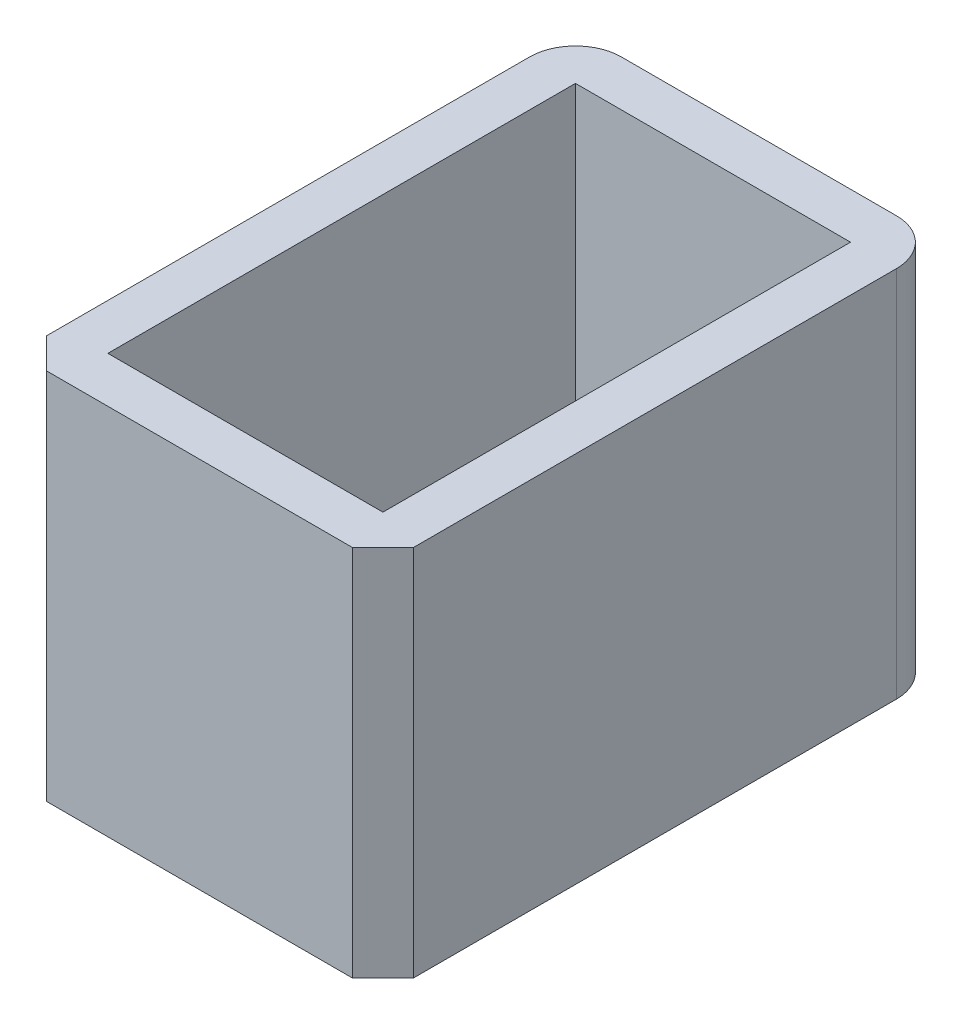
ISO-10303-21;
HEADER;
FILE_DESCRIPTION(('STEP AP214'),'2;1');
FILE_NAME('part.step','',(''),(''),'','','');
FILE_SCHEMA(('AUTOMOTIVE_DESIGN { 1 0 10303 214 1 1 1 1 }'));
ENDSEC;
DATA;
#1=APPLICATION_CONTEXT('core data for automotive mechanical design processes');
#2=APPLICATION_PROTOCOL_DEFINITION('international standard','automotive_design',2000,#1);
#3=PRODUCT_CONTEXT('',#1,'mechanical');
#4=PRODUCT('Part','Part','',(#3));
#5=PRODUCT_RELATED_PRODUCT_CATEGORY('part','',(#4));
#6=PRODUCT_DEFINITION_FORMATION('','',#4);
#7=PRODUCT_DEFINITION_CONTEXT('part definition',#1,'design');
#8=PRODUCT_DEFINITION('design','',#6,#7);
#9=PRODUCT_DEFINITION_SHAPE('','',#8);
#10=(LENGTH_UNIT() NAMED_UNIT(*) SI_UNIT(.MILLI.,.METRE.));
#11=(NAMED_UNIT(*) PLANE_ANGLE_UNIT() SI_UNIT($,.RADIAN.));
#12=(NAMED_UNIT(*) SI_UNIT($,.STERADIAN.) SOLID_ANGLE_UNIT());
#13=UNCERTAINTY_MEASURE_WITH_UNIT(LENGTH_MEASURE(1.E-05),#10,'distance_accuracy_value','');
#14=(GEOMETRIC_REPRESENTATION_CONTEXT(3) GLOBAL_UNCERTAINTY_ASSIGNED_CONTEXT((#13)) GLOBAL_UNIT_ASSIGNED_CONTEXT((#10,
#11,#12)) REPRESENTATION_CONTEXT('',''));
#15=CARTESIAN_POINT('',(0.,0.,0.));
#16=DIRECTION('',(0.,0.,1.));
#17=DIRECTION('',(1.,0.,0.));
#18=AXIS2_PLACEMENT_3D('',#15,#16,#17);
#19=CARTESIAN_POINT('',(0.,24.4,0.));
#20=DIRECTION('',(1.,0.,0.));
#21=DIRECTION('',(0.,0.,-1.));
#22=AXIS2_PLACEMENT_3D('',#19,#20,#21);
#23=PLANE('',#22);
#24=DIRECTION('',(0.,0.,1.));
#25=VECTOR('',#24,1.);
#26=CARTESIAN_POINT('',(0.,0.,0.));
#27=LINE('',#26,#25);
#28=CARTESIAN_POINT('',(0.,0.,-33.6));
#29=VERTEX_POINT('',#28);
#30=CARTESIAN_POINT('',(0.,0.,-2.00000000000001));
#31=VERTEX_POINT('',#30);
#32=EDGE_CURVE('E167',#29,#31,#27,.T.);
#33=ORIENTED_EDGE('',*,*,#32,.T.);
#34=DIRECTION('',(0.,1.,0.));
#35=VECTOR('',#34,1.);
#36=CARTESIAN_POINT('',(0.,24.4,-2.00000000000001));
#37=LINE('',#36,#35);
#38=CARTESIAN_POINT('',(0.,24.4,-2.00000000000001));
#39=VERTEX_POINT('',#38);
#40=EDGE_CURVE('E11',#31,#39,#37,.T.);
#41=ORIENTED_EDGE('',*,*,#40,.T.);
#42=DIRECTION('',(0.,0.,1.));
#43=VECTOR('',#42,1.);
#44=CARTESIAN_POINT('',(0.,24.4,0.));
#45=LINE('',#44,#43);
#46=CARTESIAN_POINT('',(0.,24.4,-33.6));
#47=VERTEX_POINT('',#46);
#48=EDGE_CURVE('E171',#47,#39,#45,.T.);
#49=ORIENTED_EDGE('',*,*,#48,.F.);
#50=DIRECTION('',(0.,-1.,0.));
#51=VECTOR('',#50,1.);
#52=CARTESIAN_POINT('',(0.,24.4,-33.6));
#53=LINE('',#52,#51);
#54=EDGE_CURVE('E205',#47,#29,#53,.T.);
#55=ORIENTED_EDGE('',*,*,#54,.T.);
#56=EDGE_LOOP('',(#33,#41,#49,#55));
#57=FACE_BOUND('',#56,.T.);
#58=ADVANCED_FACE('F35',(#57),#23,.F.);
#59=CARTESIAN_POINT('',(0.,24.4,0.));
#60=DIRECTION('',(0.,0.,-1.));
#61=DIRECTION('',(-1.,0.,0.));
#62=AXIS2_PLACEMENT_3D('',#59,#60,#61);
#63=PLANE('',#62);
#64=DIRECTION('',(1.,0.,0.));
#65=VECTOR('',#64,1.);
#66=CARTESIAN_POINT('',(0.,0.,0.));
#67=LINE('',#66,#65);
#68=CARTESIAN_POINT('',(1.99999999999999,0.,0.));
#69=VERTEX_POINT('',#68);
#70=CARTESIAN_POINT('',(22.,0.,0.));
#71=VERTEX_POINT('',#70);
#72=EDGE_CURVE('E183',#69,#71,#67,.T.);
#73=ORIENTED_EDGE('',*,*,#72,.T.);
#74=DIRECTION('',(0.,1.,0.));
#75=VECTOR('',#74,1.);
#76=CARTESIAN_POINT('',(22.,24.4,0.));
#77=LINE('',#76,#75);
#78=CARTESIAN_POINT('',(22.,24.4,0.));
#79=VERTEX_POINT('',#78);
#80=EDGE_CURVE('E57',#71,#79,#77,.T.);
#81=ORIENTED_EDGE('',*,*,#80,.T.);
#82=DIRECTION('',(1.,0.,0.));
#83=VECTOR('',#82,1.);
#84=CARTESIAN_POINT('',(0.,24.4,0.));
#85=LINE('',#84,#83);
#86=CARTESIAN_POINT('',(1.99999999999999,24.4,0.));
#87=VERTEX_POINT('',#86);
#88=EDGE_CURVE('E173',#87,#79,#85,.T.);
#89=ORIENTED_EDGE('',*,*,#88,.F.);
#90=DIRECTION('',(0.,-1.,0.));
#91=VECTOR('',#90,1.);
#92=CARTESIAN_POINT('',(1.99999999999999,24.4,0.));
#93=LINE('',#92,#91);
#94=EDGE_CURVE('E215',#87,#69,#93,.T.);
#95=ORIENTED_EDGE('',*,*,#94,.T.);
#96=EDGE_LOOP('',(#73,#81,#89,#95));
#97=FACE_BOUND('',#96,.T.);
#98=ADVANCED_FACE('F233',(#97),#63,.F.);
#99=CARTESIAN_POINT('',(24.,24.4,0.));
#100=DIRECTION('',(-1.,0.,0.));
#101=DIRECTION('',(0.,0.,1.));
#102=AXIS2_PLACEMENT_3D('',#99,#100,#101);
#103=PLANE('',#102);
#104=DIRECTION('',(0.,0.,-1.));
#105=VECTOR('',#104,1.);
#106=CARTESIAN_POINT('',(24.,24.4,0.));
#107=LINE('',#106,#105);
#108=CARTESIAN_POINT('',(24.,24.4,-1.99999999999999));
#109=VERTEX_POINT('',#108);
#110=CARTESIAN_POINT('',(24.,24.4,-33.6));
#111=VERTEX_POINT('',#110);
#112=EDGE_CURVE('E176',#109,#111,#107,.T.);
#113=ORIENTED_EDGE('',*,*,#112,.F.);
#114=DIRECTION('',(0.,-1.,0.));
#115=VECTOR('',#114,1.);
#116=CARTESIAN_POINT('',(24.,24.4,-1.99999999999999));
#117=LINE('',#116,#115);
#118=CARTESIAN_POINT('',(24.,0.,-1.99999999999999));
#119=VERTEX_POINT('',#118);
#120=EDGE_CURVE('E208',#109,#119,#117,.T.);
#121=ORIENTED_EDGE('',*,*,#120,.T.);
#122=DIRECTION('',(0.,0.,-1.));
#123=VECTOR('',#122,1.);
#124=CARTESIAN_POINT('',(24.,0.,0.));
#125=LINE('',#124,#123);
#126=CARTESIAN_POINT('',(24.,0.,-33.6));
#127=VERTEX_POINT('',#126);
#128=EDGE_CURVE('E185',#119,#127,#125,.T.);
#129=ORIENTED_EDGE('',*,*,#128,.T.);
#130=DIRECTION('',(0.,-1.,0.));
#131=VECTOR('',#130,1.);
#132=CARTESIAN_POINT('',(24.,24.4,-33.6));
#133=LINE('',#132,#131);
#134=EDGE_CURVE('E198',#127,#111,#133,.F.);
#135=ORIENTED_EDGE('',*,*,#134,.T.);
#136=EDGE_LOOP('',(#113,#121,#129,#135));
#137=FACE_BOUND('',#136,.T.);
#138=ADVANCED_FACE('F227',(#137),#103,.F.);
#139=CARTESIAN_POINT('',(0.,24.4,-36.6));
#140=DIRECTION('',(0.,0.,1.));
#141=DIRECTION('',(1.,0.,0.));
#142=AXIS2_PLACEMENT_3D('',#139,#140,#141);
#143=PLANE('',#142);
#144=DIRECTION('',(-1.,0.,0.));
#145=VECTOR('',#144,1.);
#146=CARTESIAN_POINT('',(0.,24.4,-36.6));
#147=LINE('',#146,#145);
#148=CARTESIAN_POINT('',(21.,24.4,-36.6));
#149=VERTEX_POINT('',#148);
#150=CARTESIAN_POINT('',(3.,24.4,-36.6));
#151=VERTEX_POINT('',#150);
#152=EDGE_CURVE('E178',#149,#151,#147,.T.);
#153=ORIENTED_EDGE('',*,*,#152,.F.);
#154=DIRECTION('',(0.,-1.,0.));
#155=VECTOR('',#154,1.);
#156=CARTESIAN_POINT('',(21.,24.4,-36.6));
#157=LINE('',#156,#155);
#158=CARTESIAN_POINT('',(21.,0.,-36.6));
#159=VERTEX_POINT('',#158);
#160=EDGE_CURVE('E190',#149,#159,#157,.T.);
#161=ORIENTED_EDGE('',*,*,#160,.T.);
#162=DIRECTION('',(-1.,0.,0.));
#163=VECTOR('',#162,1.);
#164=CARTESIAN_POINT('',(0.,0.,-36.6));
#165=LINE('',#164,#163);
#166=CARTESIAN_POINT('',(3.,0.,-36.6));
#167=VERTEX_POINT('',#166);
#168=EDGE_CURVE('E174',#159,#167,#165,.T.);
#169=ORIENTED_EDGE('',*,*,#168,.T.);
#170=DIRECTION('',(0.,-1.,0.));
#171=VECTOR('',#170,1.);
#172=CARTESIAN_POINT('',(3.,24.4,-36.6));
#173=LINE('',#172,#171);
#174=EDGE_CURVE('E181',#167,#151,#173,.F.);
#175=ORIENTED_EDGE('',*,*,#174,.T.);
#176=EDGE_LOOP('',(#153,#161,#169,#175));
#177=FACE_BOUND('',#176,.T.);
#178=ADVANCED_FACE('F246',(#177),#143,.F.);
#179=CARTESIAN_POINT('',(0.,24.4,0.));
#180=DIRECTION('',(0.,-1.,0.));
#181=DIRECTION('',(0.,0.,-1.));
#182=AXIS2_PLACEMENT_3D('',#179,#180,#181);
#183=PLANE('',#182);
#184=DIRECTION('',(1.,0.,0.));
#185=VECTOR('',#184,1.);
#186=CARTESIAN_POINT('',(3.,24.4,-3.));
#187=LINE('',#186,#185);
#188=CARTESIAN_POINT('',(3.,24.4,-3.));
#189=VERTEX_POINT('',#188);
#190=CARTESIAN_POINT('',(21.,24.4,-3.));
#191=VERTEX_POINT('',#190);
#192=EDGE_CURVE('E161',#189,#191,#187,.T.);
#193=ORIENTED_EDGE('',*,*,#192,.F.);
#194=DIRECTION('',(0.,0.,1.));
#195=VECTOR('',#194,1.);
#196=CARTESIAN_POINT('',(3.,24.4,-33.6));
#197=LINE('',#196,#195);
#198=CARTESIAN_POINT('',(3.,24.4,-33.6));
#199=VERTEX_POINT('',#198);
#200=EDGE_CURVE('E134',#199,#189,#197,.T.);
#201=ORIENTED_EDGE('',*,*,#200,.F.);
#202=DIRECTION('',(-1.,0.,0.));
#203=VECTOR('',#202,1.);
#204=CARTESIAN_POINT('',(3.,24.4,-33.6));
#205=LINE('',#204,#203);
#206=CARTESIAN_POINT('',(21.,24.4,-33.6));
#207=VERTEX_POINT('',#206);
#208=EDGE_CURVE('E152',#207,#199,#205,.T.);
#209=ORIENTED_EDGE('',*,*,#208,.F.);
#210=DIRECTION('',(0.,0.,-1.));
#211=VECTOR('',#210,1.);
#212=CARTESIAN_POINT('',(21.,24.4,-33.6));
#213=LINE('',#212,#211);
#214=EDGE_CURVE('E155',#191,#207,#213,.T.);
#215=ORIENTED_EDGE('',*,*,#214,.F.);
#216=EDGE_LOOP('',(#193,#201,#209,#215));
#217=FACE_BOUND('',#216,.T.);
#218=ORIENTED_EDGE('',*,*,#88,.T.);
#219=DIRECTION('',(-0.70710678118655,0.,0.707106781186545));
#220=VECTOR('',#219,1.);
#221=CARTESIAN_POINT('',(24.,24.4,-1.99999999999999));
#222=LINE('',#221,#220);
#223=EDGE_CURVE('E44',#79,#109,#222,.F.);
#224=ORIENTED_EDGE('',*,*,#223,.T.);
#225=ORIENTED_EDGE('',*,*,#112,.T.);
#226=CARTESIAN_POINT('',(21.,24.4,-33.6));
#227=DIRECTION('',(0.,-1.,0.));
#228=DIRECTION('',(0.,0.,-1.));
#229=AXIS2_PLACEMENT_3D('',#226,#227,#228);
#230=CIRCLE('',#229,3.);
#231=EDGE_CURVE('E203',#111,#149,#230,.F.);
#232=ORIENTED_EDGE('',*,*,#231,.T.);
#233=ORIENTED_EDGE('',*,*,#152,.T.);
#234=CARTESIAN_POINT('',(3.,24.4,-33.6));
#235=DIRECTION('',(0.,-1.,0.));
#236=DIRECTION('',(0.,0.,-1.));
#237=AXIS2_PLACEMENT_3D('',#234,#235,#236);
#238=CIRCLE('',#237,3.);
#239=EDGE_CURVE('E201',#151,#47,#238,.F.);
#240=ORIENTED_EDGE('',*,*,#239,.T.);
#241=ORIENTED_EDGE('',*,*,#48,.T.);
#242=DIRECTION('',(-0.707106781186545,0.,-0.70710678118655));
#243=VECTOR('',#242,1.);
#244=CARTESIAN_POINT('',(1.99999999999999,24.4,0.));
#245=LINE('',#244,#243);
#246=EDGE_CURVE('E219',#39,#87,#245,.F.);
#247=ORIENTED_EDGE('',*,*,#246,.T.);
#248=EDGE_LOOP('',(#218,#224,#225,#232,#233,#240,#241,#247));
#249=FACE_BOUND('',#248,.T.);
#250=ADVANCED_FACE('F223',(#217,#249),#183,.F.);
#251=CARTESIAN_POINT('',(0.,0.,0.));
#252=DIRECTION('',(0.,-1.,0.));
#253=DIRECTION('',(0.,0.,-1.));
#254=AXIS2_PLACEMENT_3D('',#251,#252,#253);
#255=PLANE('',#254);
#256=DIRECTION('',(0.,0.,1.));
#257=VECTOR('',#256,1.);
#258=CARTESIAN_POINT('',(3.,0.,-33.6));
#259=LINE('',#258,#257);
#260=CARTESIAN_POINT('',(3.,0.,-33.6));
#261=VERTEX_POINT('',#260);
#262=CARTESIAN_POINT('',(3.,0.,-3.));
#263=VERTEX_POINT('',#262);
#264=EDGE_CURVE('E131',#261,#263,#259,.T.);
#265=ORIENTED_EDGE('',*,*,#264,.T.);
#266=DIRECTION('',(1.,0.,0.));
#267=VECTOR('',#266,1.);
#268=CARTESIAN_POINT('',(3.,0.,-3.));
#269=LINE('',#268,#267);
#270=CARTESIAN_POINT('',(21.,0.,-3.));
#271=VERTEX_POINT('',#270);
#272=EDGE_CURVE('E143',#263,#271,#269,.T.);
#273=ORIENTED_EDGE('',*,*,#272,.T.);
#274=DIRECTION('',(0.,0.,-1.));
#275=VECTOR('',#274,1.);
#276=CARTESIAN_POINT('',(21.,0.,-33.6));
#277=LINE('',#276,#275);
#278=CARTESIAN_POINT('',(21.,0.,-33.6));
#279=VERTEX_POINT('',#278);
#280=EDGE_CURVE('E147',#271,#279,#277,.T.);
#281=ORIENTED_EDGE('',*,*,#280,.T.);
#282=DIRECTION('',(-1.,0.,0.));
#283=VECTOR('',#282,1.);
#284=CARTESIAN_POINT('',(3.,0.,-33.6));
#285=LINE('',#284,#283);
#286=EDGE_CURVE('E139',#279,#261,#285,.T.);
#287=ORIENTED_EDGE('',*,*,#286,.T.);
#288=EDGE_LOOP('',(#265,#273,#281,#287));
#289=FACE_BOUND('',#288,.T.);
#290=ORIENTED_EDGE('',*,*,#128,.F.);
#291=DIRECTION('',(0.70710678118655,0.,-0.707106781186545));
#292=VECTOR('',#291,1.);
#293=CARTESIAN_POINT('',(10.9999999999999,0.,11.));
#294=LINE('',#293,#292);
#295=EDGE_CURVE('E213',#119,#71,#294,.F.);
#296=ORIENTED_EDGE('',*,*,#295,.T.);
#297=ORIENTED_EDGE('',*,*,#72,.F.);
#298=DIRECTION('',(0.707106781186545,0.,0.70710678118655));
#299=VECTOR('',#298,1.);
#300=CARTESIAN_POINT('',(1.,0.,-0.999999999999997));
#301=LINE('',#300,#299);
#302=EDGE_CURVE('E211',#69,#31,#301,.F.);
#303=ORIENTED_EDGE('',*,*,#302,.T.);
#304=ORIENTED_EDGE('',*,*,#32,.F.);
#305=CARTESIAN_POINT('',(3.,0.,-33.6));
#306=DIRECTION('',(0.,-1.,0.));
#307=DIRECTION('',(0.,0.,-1.));
#308=AXIS2_PLACEMENT_3D('',#305,#306,#307);
#309=CIRCLE('',#308,3.);
#310=EDGE_CURVE('E193',#29,#167,#309,.T.);
#311=ORIENTED_EDGE('',*,*,#310,.T.);
#312=ORIENTED_EDGE('',*,*,#168,.F.);
#313=CARTESIAN_POINT('',(21.,0.,-33.6));
#314=DIRECTION('',(0.,-1.,0.));
#315=DIRECTION('',(0.,0.,-1.));
#316=AXIS2_PLACEMENT_3D('',#313,#314,#315);
#317=CIRCLE('',#316,3.);
#318=EDGE_CURVE('E195',#159,#127,#317,.T.);
#319=ORIENTED_EDGE('',*,*,#318,.T.);
#320=EDGE_LOOP('',(#290,#296,#297,#303,#304,#311,#312,#319));
#321=FACE_BOUND('',#320,.T.);
#322=ADVANCED_FACE('F149',(#289,#321),#255,.T.);
#323=CARTESIAN_POINT('',(3.,0.,-33.6));
#324=DIRECTION('',(-1.,0.,0.));
#325=DIRECTION('',(0.,0.,1.));
#326=AXIS2_PLACEMENT_3D('',#323,#324,#325);
#327=PLANE('',#326);
#328=ORIENTED_EDGE('',*,*,#200,.T.);
#329=DIRECTION('',(0.,1.,0.));
#330=VECTOR('',#329,1.);
#331=CARTESIAN_POINT('',(3.,0.,-3.));
#332=LINE('',#331,#330);
#333=EDGE_CURVE('E127',#263,#189,#332,.T.);
#334=ORIENTED_EDGE('',*,*,#333,.F.);
#335=ORIENTED_EDGE('',*,*,#264,.F.);
#336=DIRECTION('',(0.,1.,0.));
#337=VECTOR('',#336,1.);
#338=CARTESIAN_POINT('',(3.,0.,-33.6));
#339=LINE('',#338,#337);
#340=EDGE_CURVE('E165',#261,#199,#339,.T.);
#341=ORIENTED_EDGE('',*,*,#340,.T.);
#342=EDGE_LOOP('',(#328,#334,#335,#341));
#343=FACE_BOUND('',#342,.T.);
#344=ADVANCED_FACE('F129',(#343),#327,.F.);
#345=CARTESIAN_POINT('',(3.,0.,-33.6));
#346=DIRECTION('',(0.,0.,-1.));
#347=DIRECTION('',(-1.,0.,0.));
#348=AXIS2_PLACEMENT_3D('',#345,#346,#347);
#349=PLANE('',#348);
#350=ORIENTED_EDGE('',*,*,#208,.T.);
#351=ORIENTED_EDGE('',*,*,#340,.F.);
#352=ORIENTED_EDGE('',*,*,#286,.F.);
#353=DIRECTION('',(0.,1.,0.));
#354=VECTOR('',#353,1.);
#355=CARTESIAN_POINT('',(21.,0.,-33.6));
#356=LINE('',#355,#354);
#357=EDGE_CURVE('E168',#279,#207,#356,.T.);
#358=ORIENTED_EDGE('',*,*,#357,.T.);
#359=EDGE_LOOP('',(#350,#351,#352,#358));
#360=FACE_BOUND('',#359,.T.);
#361=ADVANCED_FACE('F276',(#360),#349,.F.);
#362=CARTESIAN_POINT('',(21.,0.,-33.6));
#363=DIRECTION('',(1.,0.,0.));
#364=DIRECTION('',(0.,0.,-1.));
#365=AXIS2_PLACEMENT_3D('',#362,#363,#364);
#366=PLANE('',#365);
#367=ORIENTED_EDGE('',*,*,#214,.T.);
#368=ORIENTED_EDGE('',*,*,#357,.F.);
#369=ORIENTED_EDGE('',*,*,#280,.F.);
#370=DIRECTION('',(0.,1.,0.));
#371=VECTOR('',#370,1.);
#372=CARTESIAN_POINT('',(21.,0.,-3.));
#373=LINE('',#372,#371);
#374=EDGE_CURVE('E138',#271,#191,#373,.T.);
#375=ORIENTED_EDGE('',*,*,#374,.T.);
#376=EDGE_LOOP('',(#367,#368,#369,#375));
#377=FACE_BOUND('',#376,.T.);
#378=ADVANCED_FACE('F257',(#377),#366,.F.);
#379=CARTESIAN_POINT('',(3.,0.,-3.));
#380=DIRECTION('',(0.,0.,1.));
#381=DIRECTION('',(1.,0.,0.));
#382=AXIS2_PLACEMENT_3D('',#379,#380,#381);
#383=PLANE('',#382);
#384=ORIENTED_EDGE('',*,*,#192,.T.);
#385=ORIENTED_EDGE('',*,*,#374,.F.);
#386=ORIENTED_EDGE('',*,*,#272,.F.);
#387=ORIENTED_EDGE('',*,*,#333,.T.);
#388=EDGE_LOOP('',(#384,#385,#386,#387));
#389=FACE_BOUND('',#388,.T.);
#390=ADVANCED_FACE('F144',(#389),#383,.F.);
#391=CARTESIAN_POINT('',(21.,24.4,-33.6));
#392=DIRECTION('',(0.,-1.,0.));
#393=DIRECTION('',(0.,0.,-1.));
#394=AXIS2_PLACEMENT_3D('',#391,#392,#393);
#395=CYLINDRICAL_SURFACE('',#394,3.);
#396=ORIENTED_EDGE('',*,*,#231,.F.);
#397=ORIENTED_EDGE('',*,*,#134,.F.);
#398=ORIENTED_EDGE('',*,*,#318,.F.);
#399=ORIENTED_EDGE('',*,*,#160,.F.);
#400=EDGE_LOOP('',(#396,#397,#398,#399));
#401=FACE_BOUND('',#400,.T.);
#402=ADVANCED_FACE('F249',(#401),#395,.T.);
#403=CARTESIAN_POINT('',(3.,24.4,-33.6));
#404=DIRECTION('',(0.,-1.,0.));
#405=DIRECTION('',(0.,0.,-1.));
#406=AXIS2_PLACEMENT_3D('',#403,#404,#405);
#407=CYLINDRICAL_SURFACE('',#406,3.);
#408=ORIENTED_EDGE('',*,*,#239,.F.);
#409=ORIENTED_EDGE('',*,*,#174,.F.);
#410=ORIENTED_EDGE('',*,*,#310,.F.);
#411=ORIENTED_EDGE('',*,*,#54,.F.);
#412=EDGE_LOOP('',(#408,#409,#410,#411));
#413=FACE_BOUND('',#412,.T.);
#414=ADVANCED_FACE('F241',(#413),#407,.T.);
#415=CARTESIAN_POINT('',(24.,24.4,-1.99999999999999));
#416=DIRECTION('',(-0.707106781186545,0.,-0.70710678118655));
#417=DIRECTION('',(0.,-1.,0.));
#418=AXIS2_PLACEMENT_3D('',#415,#416,#417);
#419=PLANE('',#418);
#420=ORIENTED_EDGE('',*,*,#223,.F.);
#421=ORIENTED_EDGE('',*,*,#80,.F.);
#422=ORIENTED_EDGE('',*,*,#295,.F.);
#423=ORIENTED_EDGE('',*,*,#120,.F.);
#424=EDGE_LOOP('',(#420,#421,#422,#423));
#425=FACE_BOUND('',#424,.T.);
#426=ADVANCED_FACE('F231',(#425),#419,.F.);
#427=CARTESIAN_POINT('',(1.99999999999999,24.4,0.));
#428=DIRECTION('',(0.70710678118655,0.,-0.707106781186545));
#429=DIRECTION('',(0.,-1.,0.));
#430=AXIS2_PLACEMENT_3D('',#427,#428,#429);
#431=PLANE('',#430);
#432=ORIENTED_EDGE('',*,*,#246,.F.);
#433=ORIENTED_EDGE('',*,*,#40,.F.);
#434=ORIENTED_EDGE('',*,*,#302,.F.);
#435=ORIENTED_EDGE('',*,*,#94,.F.);
#436=EDGE_LOOP('',(#432,#433,#434,#435));
#437=FACE_BOUND('',#436,.T.);
#438=ADVANCED_FACE('F38',(#437),#431,.F.);
#439=CLOSED_SHELL('',(#58,#98,#138,#178,#250,#322,#344,#361,#378,#390,#402,#414,#426,#438));
#440=MANIFOLD_SOLID_BREP('B2',#439);
#441=ADVANCED_BREP_SHAPE_REPRESENTATION('',(#18,#440),#14);
#442=SHAPE_DEFINITION_REPRESENTATION(#9,#441);
ENDSEC;
END-ISO-10303-21;
